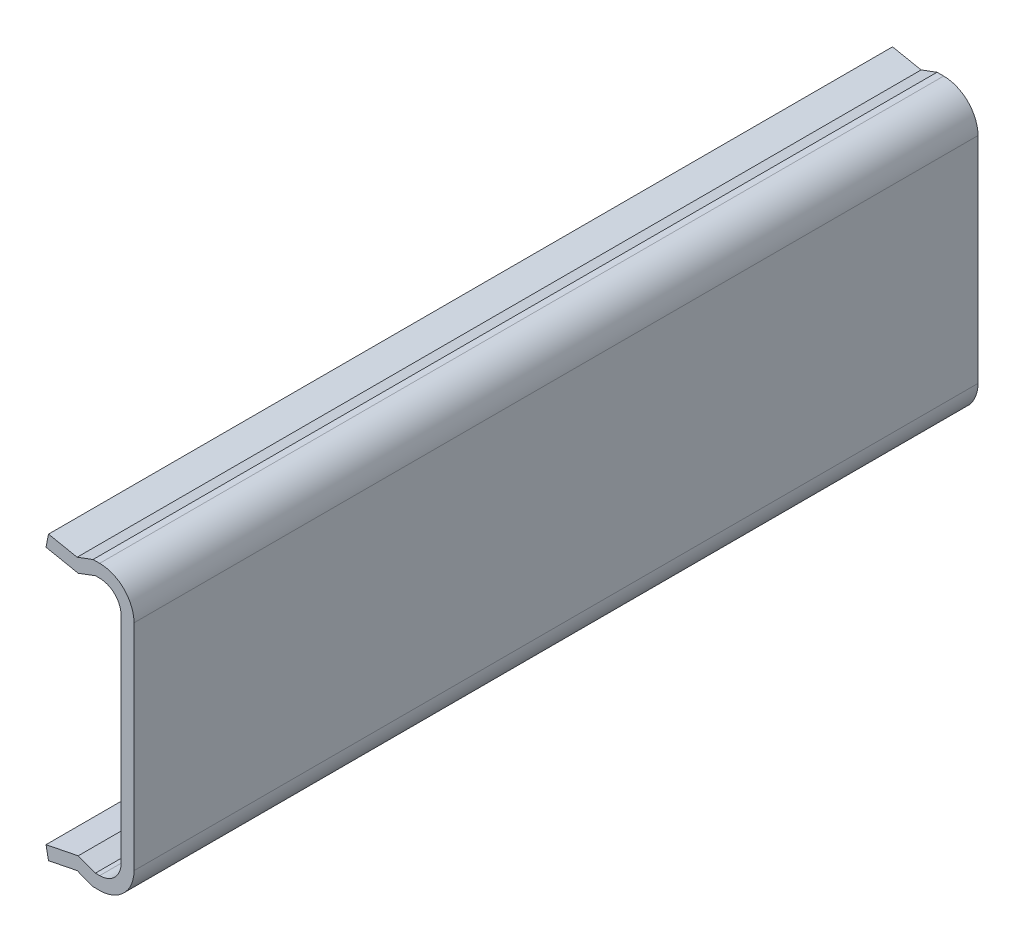
ISO-10303-21;
HEADER;
FILE_DESCRIPTION(('STEP AP214'),'2;1');
FILE_NAME('part.step','',(''),(''),'','','');
FILE_SCHEMA(('AUTOMOTIVE_DESIGN { 1 0 10303 214 1 1 1 1 }'));
ENDSEC;
DATA;
#1=APPLICATION_CONTEXT('core data for automotive mechanical design processes');
#2=APPLICATION_PROTOCOL_DEFINITION('international standard','automotive_design',2000,#1);
#3=PRODUCT_CONTEXT('',#1,'mechanical');
#4=PRODUCT('Part','Part','',(#3));
#5=PRODUCT_RELATED_PRODUCT_CATEGORY('part','',(#4));
#6=PRODUCT_DEFINITION_FORMATION('','',#4);
#7=PRODUCT_DEFINITION_CONTEXT('part definition',#1,'design');
#8=PRODUCT_DEFINITION('design','',#6,#7);
#9=PRODUCT_DEFINITION_SHAPE('','',#8);
#10=(LENGTH_UNIT() NAMED_UNIT(*) SI_UNIT(.MILLI.,.METRE.));
#11=(NAMED_UNIT(*) PLANE_ANGLE_UNIT() SI_UNIT($,.RADIAN.));
#12=(NAMED_UNIT(*) SI_UNIT($,.STERADIAN.) SOLID_ANGLE_UNIT());
#13=UNCERTAINTY_MEASURE_WITH_UNIT(LENGTH_MEASURE(1.E-05),#10,'distance_accuracy_value','');
#14=(GEOMETRIC_REPRESENTATION_CONTEXT(3) GLOBAL_UNCERTAINTY_ASSIGNED_CONTEXT((#13)) GLOBAL_UNIT_ASSIGNED_CONTEXT((#10,
#11,#12)) REPRESENTATION_CONTEXT('',''));
#15=CARTESIAN_POINT('',(0.,0.,0.));
#16=DIRECTION('',(0.,0.,1.));
#17=DIRECTION('',(1.,0.,0.));
#18=AXIS2_PLACEMENT_3D('',#15,#16,#17);
#19=CARTESIAN_POINT('',(46.5672961328672,-11.017405418431,51.1382842231858));
#20=DIRECTION('',(0.196116135138185,-0.98058067569092,0.));
#21=DIRECTION('',(0.98058067569092,0.196116135138185,0.));
#22=AXIS2_PLACEMENT_3D('',#19,#20,#21);
#23=PLANE('',#22);
#24=DIRECTION('',(0.,0.,1.));
#25=VECTOR('',#24,1.);
#26=CARTESIAN_POINT('',(46.5672961328672,-11.017405418431,51.1382842231858));
#27=LINE('',#26,#25);
#28=CARTESIAN_POINT('',(46.5672961328672,-11.017405418431,37.3162004439577));
#29=VERTEX_POINT('',#28);
#30=CARTESIAN_POINT('',(46.5672961328672,-11.017405418431,-2.00379955604232));
#31=VERTEX_POINT('',#30);
#32=EDGE_CURVE('E179',#29,#31,#27,.F.);
#33=ORIENTED_EDGE('',*,*,#32,.T.);
#34=DIRECTION('',(0.98058067569092,0.196116135138185,0.));
#35=VECTOR('',#34,1.);
#36=CARTESIAN_POINT('',(46.5672961328672,-11.017405418431,-2.00379955604231));
#37=LINE('',#36,#35);
#38=CARTESIAN_POINT('',(45.0672961328672,-11.317405418431,-2.00379955604232));
#39=VERTEX_POINT('',#38);
#40=EDGE_CURVE('E233',#39,#31,#37,.T.);
#41=ORIENTED_EDGE('',*,*,#40,.F.);
#42=DIRECTION('',(0.,0.,1.));
#43=VECTOR('',#42,1.);
#44=CARTESIAN_POINT('',(45.0672961328672,-11.317405418431,51.1382842231858));
#45=LINE('',#44,#43);
#46=CARTESIAN_POINT('',(45.0672961328672,-11.317405418431,37.3162004439577));
#47=VERTEX_POINT('',#46);
#48=EDGE_CURVE('E189',#39,#47,#45,.T.);
#49=ORIENTED_EDGE('',*,*,#48,.T.);
#50=DIRECTION('',(0.98058067569092,0.196116135138185,0.));
#51=VECTOR('',#50,1.);
#52=CARTESIAN_POINT('',(46.5672961328672,-11.017405418431,37.3162004439577));
#53=LINE('',#52,#51);
#54=EDGE_CURVE('E224',#29,#47,#53,.F.);
#55=ORIENTED_EDGE('',*,*,#54,.F.);
#56=EDGE_LOOP('',(#33,#41,#49,#55));
#57=FACE_BOUND('',#56,.T.);
#58=ADVANCED_FACE('F16',(#57),#23,.F.);
#59=CARTESIAN_POINT('',(45.0672961328672,0.682594581569037,51.1382842231858));
#60=DIRECTION('',(0.196116135138185,0.98058067569092,0.));
#61=DIRECTION('',(-0.98058067569092,0.196116135138185,0.));
#62=AXIS2_PLACEMENT_3D('',#59,#60,#61);
#63=PLANE('',#62);
#64=DIRECTION('',(0.,0.,1.));
#65=VECTOR('',#64,1.);
#66=CARTESIAN_POINT('',(45.0672961328672,0.682594581569036,51.1382842231858));
#67=LINE('',#66,#65);
#68=CARTESIAN_POINT('',(45.0672961328672,0.682594581569036,37.3162004439577));
#69=VERTEX_POINT('',#68);
#70=CARTESIAN_POINT('',(45.0672961328672,0.682594581569034,-2.00379955604232));
#71=VERTEX_POINT('',#70);
#72=EDGE_CURVE('E209',#69,#71,#67,.F.);
#73=ORIENTED_EDGE('',*,*,#72,.T.);
#74=DIRECTION('',(-0.98058067569092,0.196116135138185,0.));
#75=VECTOR('',#74,1.);
#76=CARTESIAN_POINT('',(45.0672961328672,0.68259458156903,-2.00379955604231));
#77=LINE('',#76,#75);
#78=CARTESIAN_POINT('',(46.5672961328672,0.382594581569031,-2.00379955604229));
#79=VERTEX_POINT('',#78);
#80=EDGE_CURVE('E219',#79,#71,#77,.T.);
#81=ORIENTED_EDGE('',*,*,#80,.F.);
#82=DIRECTION('',(0.,0.,1.));
#83=VECTOR('',#82,1.);
#84=CARTESIAN_POINT('',(46.5672961328672,0.382594581569036,51.1382842231858));
#85=LINE('',#84,#83);
#86=CARTESIAN_POINT('',(46.5672961328672,0.382594581569035,37.3162004439577));
#87=VERTEX_POINT('',#86);
#88=EDGE_CURVE('E162',#79,#87,#85,.T.);
#89=ORIENTED_EDGE('',*,*,#88,.T.);
#90=DIRECTION('',(-0.98058067569092,0.196116135138185,0.));
#91=VECTOR('',#90,1.);
#92=CARTESIAN_POINT('',(45.0672961328672,0.682594581569035,37.3162004439577));
#93=LINE('',#92,#91);
#94=EDGE_CURVE('E216',#69,#87,#93,.F.);
#95=ORIENTED_EDGE('',*,*,#94,.F.);
#96=EDGE_LOOP('',(#73,#81,#89,#95));
#97=FACE_BOUND('',#96,.T.);
#98=ADVANCED_FACE('F348',(#97),#63,.F.);
#99=CARTESIAN_POINT('',(45.0672961328672,0.682594581569037,51.1382842231858));
#100=DIRECTION('',(0.98058067569092,-0.196116135138185,0.));
#101=DIRECTION('',(0.196116135138185,0.98058067569092,0.));
#102=AXIS2_PLACEMENT_3D('',#99,#100,#101);
#103=PLANE('',#102);
#104=DIRECTION('',(0.,0.,1.));
#105=VECTOR('',#104,1.);
#106=CARTESIAN_POINT('',(45.1849658139501,1.27094298698359,51.1382842231858));
#107=LINE('',#106,#105);
#108=CARTESIAN_POINT('',(45.1849658139501,1.27094298698359,37.3162004439577));
#109=VERTEX_POINT('',#108);
#110=CARTESIAN_POINT('',(45.1849658139501,1.27094298698358,-2.00379955604229));
#111=VERTEX_POINT('',#110);
#112=EDGE_CURVE('E151',#109,#111,#107,.F.);
#113=ORIENTED_EDGE('',*,*,#112,.T.);
#114=DIRECTION('',(0.196116135138185,0.98058067569092,0.));
#115=VECTOR('',#114,1.);
#116=CARTESIAN_POINT('',(45.0672961328672,0.682594581569038,-2.00379955604231));
#117=LINE('',#116,#115);
#118=EDGE_CURVE('E204',#71,#111,#117,.T.);
#119=ORIENTED_EDGE('',*,*,#118,.F.);
#120=ORIENTED_EDGE('',*,*,#72,.F.);
#121=DIRECTION('',(0.196116135138185,0.98058067569092,0.));
#122=VECTOR('',#121,1.);
#123=CARTESIAN_POINT('',(45.0672961328672,0.682594581569037,37.3162004439577));
#124=LINE('',#123,#122);
#125=EDGE_CURVE('E195',#109,#69,#124,.F.);
#126=ORIENTED_EDGE('',*,*,#125,.F.);
#127=EDGE_LOOP('',(#113,#119,#120,#126));
#128=FACE_BOUND('',#127,.T.);
#129=ADVANCED_FACE('F442',(#128),#103,.F.);
#130=CARTESIAN_POINT('',(45.0672961328672,-11.317405418431,51.1382842231858));
#131=DIRECTION('',(0.98058067569092,0.196116135138186,0.));
#132=DIRECTION('',(-0.196116135138186,0.98058067569092,0.));
#133=AXIS2_PLACEMENT_3D('',#130,#131,#132);
#134=PLANE('',#133);
#135=ORIENTED_EDGE('',*,*,#48,.F.);
#136=DIRECTION('',(-0.196116135138186,0.98058067569092,0.));
#137=VECTOR('',#136,1.);
#138=CARTESIAN_POINT('',(45.0672961328672,-11.317405418431,-2.00379955604231));
#139=LINE('',#138,#137);
#140=CARTESIAN_POINT('',(45.1849658139501,-11.9057538238455,-2.00379955604229));
#141=VERTEX_POINT('',#140);
#142=EDGE_CURVE('E192',#141,#39,#139,.T.);
#143=ORIENTED_EDGE('',*,*,#142,.F.);
#144=DIRECTION('',(0.,0.,1.));
#145=VECTOR('',#144,1.);
#146=CARTESIAN_POINT('',(45.1849658139501,-11.9057538238455,51.1382842231858));
#147=LINE('',#146,#145);
#148=CARTESIAN_POINT('',(45.1849658139501,-11.9057538238455,37.3162004439577));
#149=VERTEX_POINT('',#148);
#150=EDGE_CURVE('E129',#141,#149,#147,.T.);
#151=ORIENTED_EDGE('',*,*,#150,.T.);
#152=DIRECTION('',(-0.196116135138186,0.98058067569092,0.));
#153=VECTOR('',#152,1.);
#154=CARTESIAN_POINT('',(45.0672961328672,-11.317405418431,37.3162004439577));
#155=LINE('',#154,#153);
#156=EDGE_CURVE('E186',#47,#149,#155,.F.);
#157=ORIENTED_EDGE('',*,*,#156,.F.);
#158=EDGE_LOOP('',(#135,#143,#151,#157));
#159=FACE_BOUND('',#158,.T.);
#160=ADVANCED_FACE('F444',(#159),#134,.F.);
#161=CARTESIAN_POINT('',(47.3672961328672,-11.317405418431,51.1382842231858));
#162=DIRECTION('',(-0.351123441588394,-0.936329177569044,0.));
#163=DIRECTION('',(0.936329177569044,-0.351123441588394,0.));
#164=AXIS2_PLACEMENT_3D('',#161,#162,#163);
#165=PLANE('',#164);
#166=DIRECTION('',(0.,0.,1.));
#167=VECTOR('',#166,1.);
#168=CARTESIAN_POINT('',(47.3672961328672,-11.317405418431,51.1382842231858));
#169=LINE('',#168,#167);
#170=CARTESIAN_POINT('',(47.3672961328672,-11.317405418431,37.3162004439577));
#171=VERTEX_POINT('',#170);
#172=CARTESIAN_POINT('',(47.3672961328672,-11.317405418431,-2.00379955604229));
#173=VERTEX_POINT('',#172);
#174=EDGE_CURVE('E93',#171,#173,#169,.F.);
#175=ORIENTED_EDGE('',*,*,#174,.T.);
#176=DIRECTION('',(0.936329177569044,-0.351123441588394,0.));
#177=VECTOR('',#176,1.);
#178=CARTESIAN_POINT('',(47.3672961328672,-11.317405418431,-2.00379955604231));
#179=LINE('',#178,#177);
#180=EDGE_CURVE('E87',#31,#173,#179,.T.);
#181=ORIENTED_EDGE('',*,*,#180,.F.);
#182=ORIENTED_EDGE('',*,*,#32,.F.);
#183=DIRECTION('',(0.936329177569044,-0.351123441588394,0.));
#184=VECTOR('',#183,1.);
#185=CARTESIAN_POINT('',(47.3672961328672,-11.317405418431,37.3162004439577));
#186=LINE('',#185,#184);
#187=EDGE_CURVE('E168',#171,#29,#186,.F.);
#188=ORIENTED_EDGE('',*,*,#187,.F.);
#189=EDGE_LOOP('',(#175,#181,#182,#188));
#190=FACE_BOUND('',#189,.T.);
#191=ADVANCED_FACE('F451',(#190),#165,.F.);
#192=CARTESIAN_POINT('',(46.5672961328672,0.382594581569037,51.1382842231858));
#193=DIRECTION('',(-0.351123441588394,0.936329177569044,0.));
#194=DIRECTION('',(-0.936329177569044,-0.351123441588394,0.));
#195=AXIS2_PLACEMENT_3D('',#192,#193,#194);
#196=PLANE('',#195);
#197=ORIENTED_EDGE('',*,*,#88,.F.);
#198=DIRECTION('',(-0.936329177569044,-0.351123441588394,0.));
#199=VECTOR('',#198,1.);
#200=CARTESIAN_POINT('',(46.5672961328672,0.382594581569032,-2.00379955604228));
#201=LINE('',#200,#199);
#202=CARTESIAN_POINT('',(47.3672961328672,0.682594581569036,-2.00379955604228));
#203=VERTEX_POINT('',#202);
#204=EDGE_CURVE('E165',#203,#79,#201,.T.);
#205=ORIENTED_EDGE('',*,*,#204,.F.);
#206=DIRECTION('',(0.,0.,1.));
#207=VECTOR('',#206,1.);
#208=CARTESIAN_POINT('',(47.3672961328672,0.682594581569039,51.1382842231858));
#209=LINE('',#208,#207);
#210=CARTESIAN_POINT('',(47.3672961328672,0.682594581569039,37.3162004439577));
#211=VERTEX_POINT('',#210);
#212=EDGE_CURVE('E154',#203,#211,#209,.T.);
#213=ORIENTED_EDGE('',*,*,#212,.T.);
#214=DIRECTION('',(-0.936329177569044,-0.351123441588394,0.));
#215=VECTOR('',#214,1.);
#216=CARTESIAN_POINT('',(46.5672961328672,0.382594581569035,37.3162004439577));
#217=LINE('',#216,#215);
#218=EDGE_CURVE('E159',#87,#211,#217,.F.);
#219=ORIENTED_EDGE('',*,*,#218,.F.);
#220=EDGE_LOOP('',(#197,#205,#213,#219));
#221=FACE_BOUND('',#220,.T.);
#222=ADVANCED_FACE('F341',(#221),#196,.F.);
#223=CARTESIAN_POINT('',(45.1849658139501,1.27094298698359,51.1382842231858));
#224=DIRECTION('',(-0.196116135138185,-0.98058067569092,0.));
#225=DIRECTION('',(0.98058067569092,-0.196116135138185,0.));
#226=AXIS2_PLACEMENT_3D('',#223,#224,#225);
#227=PLANE('',#226);
#228=DIRECTION('',(0.,0.,1.));
#229=VECTOR('',#228,1.);
#230=CARTESIAN_POINT('',(46.5170040645756,1.00453533685849,51.1382842231858));
#231=LINE('',#230,#229);
#232=CARTESIAN_POINT('',(46.5170040645756,1.00453533685849,37.3162004439577));
#233=VERTEX_POINT('',#232);
#234=CARTESIAN_POINT('',(46.5170040645756,1.00453533685849,-2.00379955604228));
#235=VERTEX_POINT('',#234);
#236=EDGE_CURVE('E138',#233,#235,#231,.F.);
#237=ORIENTED_EDGE('',*,*,#236,.T.);
#238=DIRECTION('',(0.98058067569092,-0.196116135138185,0.));
#239=VECTOR('',#238,1.);
#240=CARTESIAN_POINT('',(45.1849658139501,1.27094298698358,-2.00379955604228));
#241=LINE('',#240,#239);
#242=EDGE_CURVE('E147',#111,#235,#241,.T.);
#243=ORIENTED_EDGE('',*,*,#242,.F.);
#244=ORIENTED_EDGE('',*,*,#112,.F.);
#245=DIRECTION('',(0.98058067569092,-0.196116135138185,0.));
#246=VECTOR('',#245,1.);
#247=CARTESIAN_POINT('',(45.1849658139501,1.27094298698359,37.3162004439577));
#248=LINE('',#247,#246);
#249=EDGE_CURVE('E135',#233,#109,#248,.F.);
#250=ORIENTED_EDGE('',*,*,#249,.F.);
#251=EDGE_LOOP('',(#237,#243,#244,#250));
#252=FACE_BOUND('',#251,.T.);
#253=ADVANCED_FACE('F441',(#252),#227,.F.);
#254=CARTESIAN_POINT('',(46.5170040645756,-11.6393461737204,51.1382842231858));
#255=DIRECTION('',(-0.196116135138185,0.98058067569092,0.));
#256=DIRECTION('',(-0.98058067569092,-0.196116135138185,0.));
#257=AXIS2_PLACEMENT_3D('',#254,#255,#256);
#258=PLANE('',#257);
#259=ORIENTED_EDGE('',*,*,#150,.F.);
#260=DIRECTION('',(-0.98058067569092,-0.196116135138185,0.));
#261=VECTOR('',#260,1.);
#262=CARTESIAN_POINT('',(46.5170040645756,-11.6393461737204,-2.00379955604228));
#263=LINE('',#262,#261);
#264=CARTESIAN_POINT('',(46.5170040645756,-11.6393461737204,-2.00379955604231));
#265=VERTEX_POINT('',#264);
#266=EDGE_CURVE('E132',#265,#141,#263,.T.);
#267=ORIENTED_EDGE('',*,*,#266,.F.);
#268=DIRECTION('',(0.,0.,1.));
#269=VECTOR('',#268,1.);
#270=CARTESIAN_POINT('',(46.5170040645756,-11.6393461737204,51.1382842231858));
#271=LINE('',#270,#269);
#272=CARTESIAN_POINT('',(46.5170040645756,-11.6393461737204,37.3162004439577));
#273=VERTEX_POINT('',#272);
#274=EDGE_CURVE('E109',#265,#273,#271,.T.);
#275=ORIENTED_EDGE('',*,*,#274,.T.);
#276=DIRECTION('',(-0.98058067569092,-0.196116135138185,0.));
#277=VECTOR('',#276,1.);
#278=CARTESIAN_POINT('',(46.5170040645756,-11.6393461737204,37.3162004439577));
#279=LINE('',#278,#277);
#280=EDGE_CURVE('E126',#149,#273,#279,.F.);
#281=ORIENTED_EDGE('',*,*,#280,.F.);
#282=EDGE_LOOP('',(#259,#267,#275,#281));
#283=FACE_BOUND('',#282,.T.);
#284=ADVANCED_FACE('F486',(#283),#258,.F.);
#285=CARTESIAN_POINT('',(47.5672961328672,-11.317405418431,51.1382842231858));
#286=DIRECTION('',(0.,-1.,0.));
#287=DIRECTION('',(1.,0.,0.));
#288=AXIS2_PLACEMENT_3D('',#285,#286,#287);
#289=PLANE('',#288);
#290=DIRECTION('',(0.,0.,1.));
#291=VECTOR('',#290,1.);
#292=CARTESIAN_POINT('',(47.5672961328672,-11.317405418431,51.1382842231858));
#293=LINE('',#292,#291);
#294=CARTESIAN_POINT('',(47.5672961328672,-11.317405418431,37.3162004439577));
#295=VERTEX_POINT('',#294);
#296=CARTESIAN_POINT('',(47.5672961328672,-11.317405418431,-2.00379955604228));
#297=VERTEX_POINT('',#296);
#298=EDGE_CURVE('E98',#295,#297,#293,.F.);
#299=ORIENTED_EDGE('',*,*,#298,.T.);
#300=DIRECTION('',(1.,0.,0.));
#301=VECTOR('',#300,1.);
#302=CARTESIAN_POINT('',(47.5672961328672,-11.317405418431,-2.00379955604228));
#303=LINE('',#302,#301);
#304=EDGE_CURVE('E78',#173,#297,#303,.T.);
#305=ORIENTED_EDGE('',*,*,#304,.F.);
#306=ORIENTED_EDGE('',*,*,#174,.F.);
#307=DIRECTION('',(1.,0.,0.));
#308=VECTOR('',#307,1.);
#309=CARTESIAN_POINT('',(47.5672961328672,-11.317405418431,37.3162004439577));
#310=LINE('',#309,#308);
#311=EDGE_CURVE('E92',#295,#171,#310,.F.);
#312=ORIENTED_EDGE('',*,*,#311,.F.);
#313=EDGE_LOOP('',(#299,#305,#306,#312));
#314=FACE_BOUND('',#313,.T.);
#315=ADVANCED_FACE('F104',(#314),#289,.F.);
#316=CARTESIAN_POINT('',(47.3672961328672,0.682594581569039,51.1382842231858));
#317=DIRECTION('',(0.,1.,0.));
#318=DIRECTION('',(0.,0.,1.));
#319=AXIS2_PLACEMENT_3D('',#316,#317,#318);
#320=PLANE('',#319);
#321=ORIENTED_EDGE('',*,*,#212,.F.);
#322=DIRECTION('',(1.,0.,0.));
#323=VECTOR('',#322,1.);
#324=CARTESIAN_POINT('',(47.3672961328672,0.682594581569036,-2.00379955604228));
#325=LINE('',#324,#323);
#326=CARTESIAN_POINT('',(47.5672961328672,0.682594581569035,-2.00379955604228));
#327=VERTEX_POINT('',#326);
#328=EDGE_CURVE('E116',#327,#203,#325,.F.);
#329=ORIENTED_EDGE('',*,*,#328,.F.);
#330=DIRECTION('',(0.,0.,1.));
#331=VECTOR('',#330,1.);
#332=CARTESIAN_POINT('',(47.5672961328672,0.682594581569037,51.1382842231858));
#333=LINE('',#332,#331);
#334=CARTESIAN_POINT('',(47.5672961328672,0.682594581569037,37.3162004439577));
#335=VERTEX_POINT('',#334);
#336=EDGE_CURVE('E263',#327,#335,#333,.T.);
#337=ORIENTED_EDGE('',*,*,#336,.T.);
#338=DIRECTION('',(1.,0.,0.));
#339=VECTOR('',#338,1.);
#340=CARTESIAN_POINT('',(47.3672961328672,0.682594581569038,37.3162004439577));
#341=LINE('',#340,#339);
#342=EDGE_CURVE('E142',#211,#335,#341,.T.);
#343=ORIENTED_EDGE('',*,*,#342,.F.);
#344=EDGE_LOOP('',(#321,#329,#337,#343));
#345=FACE_BOUND('',#344,.T.);
#346=ADVANCED_FACE('F331',(#345),#320,.F.);
#347=CARTESIAN_POINT('',(46.5170040645756,1.00453533685849,51.1382842231858));
#348=DIRECTION('',(0.351123441588394,-0.936329177569044,0.));
#349=DIRECTION('',(0.936329177569044,0.351123441588394,0.));
#350=AXIS2_PLACEMENT_3D('',#347,#348,#349);
#351=PLANE('',#350);
#352=DIRECTION('',(0.,0.,-1.));
#353=VECTOR('',#352,1.);
#354=CARTESIAN_POINT('',(47.2584953838037,1.28259458156904,51.1382842231858));
#355=LINE('',#354,#353);
#356=CARTESIAN_POINT('',(47.2584953838037,1.28259458156904,37.3162004439577));
#357=VERTEX_POINT('',#356);
#358=CARTESIAN_POINT('',(47.2584953838037,1.28259458156903,-2.00379955604228));
#359=VERTEX_POINT('',#358);
#360=EDGE_CURVE('E262',#357,#359,#355,.T.);
#361=ORIENTED_EDGE('',*,*,#360,.T.);
#362=DIRECTION('',(0.936329177569044,0.351123441588394,0.));
#363=VECTOR('',#362,1.);
#364=CARTESIAN_POINT('',(46.5170040645756,1.00453533685849,-2.00379955604228));
#365=LINE('',#364,#363);
#366=EDGE_CURVE('E141',#235,#359,#365,.T.);
#367=ORIENTED_EDGE('',*,*,#366,.F.);
#368=ORIENTED_EDGE('',*,*,#236,.F.);
#369=DIRECTION('',(0.936329177569044,0.351123441588394,0.));
#370=VECTOR('',#369,1.);
#371=CARTESIAN_POINT('',(46.5170040645756,1.00453533685849,37.3162004439577));
#372=LINE('',#371,#370);
#373=EDGE_CURVE('E301',#357,#233,#372,.F.);
#374=ORIENTED_EDGE('',*,*,#373,.F.);
#375=EDGE_LOOP('',(#361,#367,#368,#374));
#376=FACE_BOUND('',#375,.T.);
#377=ADVANCED_FACE('F415',(#376),#351,.F.);
#378=CARTESIAN_POINT('',(47.2584953838037,-11.917405418431,51.1382842231858));
#379=DIRECTION('',(0.351123441588394,0.936329177569044,0.));
#380=DIRECTION('',(-0.936329177569044,0.351123441588394,0.));
#381=AXIS2_PLACEMENT_3D('',#378,#379,#380);
#382=PLANE('',#381);
#383=ORIENTED_EDGE('',*,*,#274,.F.);
#384=DIRECTION('',(-0.936329177569044,0.351123441588394,0.));
#385=VECTOR('',#384,1.);
#386=CARTESIAN_POINT('',(47.2584953838037,-11.917405418431,-2.00379955604231));
#387=LINE('',#386,#385);
#388=CARTESIAN_POINT('',(47.2584953838037,-11.917405418431,-2.00379955604229));
#389=VERTEX_POINT('',#388);
#390=EDGE_CURVE('E123',#389,#265,#387,.T.);
#391=ORIENTED_EDGE('',*,*,#390,.F.);
#392=DIRECTION('',(0.,0.,1.));
#393=VECTOR('',#392,1.);
#394=CARTESIAN_POINT('',(47.2584953838037,-11.917405418431,51.1382842231858));
#395=LINE('',#394,#393);
#396=CARTESIAN_POINT('',(47.2584953838037,-11.917405418431,37.3162004439577));
#397=VERTEX_POINT('',#396);
#398=EDGE_CURVE('E281',#389,#397,#395,.T.);
#399=ORIENTED_EDGE('',*,*,#398,.T.);
#400=DIRECTION('',(-0.936329177569044,0.351123441588394,0.));
#401=VECTOR('',#400,1.);
#402=CARTESIAN_POINT('',(47.2584953838037,-11.917405418431,37.3162004439577));
#403=LINE('',#402,#401);
#404=EDGE_CURVE('E106',#273,#397,#403,.F.);
#405=ORIENTED_EDGE('',*,*,#404,.F.);
#406=EDGE_LOOP('',(#383,#391,#399,#405));
#407=FACE_BOUND('',#406,.T.);
#408=ADVANCED_FACE('F476',(#407),#382,.F.);
#409=CARTESIAN_POINT('',(47.5672961328672,-10.317405418431,51.1382842231858));
#410=DIRECTION('',(0.,0.,1.));
#411=DIRECTION('',(0.,-1.,0.));
#412=AXIS2_PLACEMENT_3D('',#409,#410,#411);
#413=CYLINDRICAL_SURFACE('',#412,0.999999999999999);
#414=DIRECTION('',(0.,0.,1.));
#415=VECTOR('',#414,1.);
#416=CARTESIAN_POINT('',(48.5672961328672,-10.317405418431,51.1382842231858));
#417=LINE('',#416,#415);
#418=CARTESIAN_POINT('',(48.5672961328672,-10.317405418431,37.3162004439577));
#419=VERTEX_POINT('',#418);
#420=CARTESIAN_POINT('',(48.5672961328672,-10.317405418431,-2.00379955604228));
#421=VERTEX_POINT('',#420);
#422=EDGE_CURVE('E101',#419,#421,#417,.F.);
#423=ORIENTED_EDGE('',*,*,#422,.T.);
#424=CARTESIAN_POINT('',(47.5672961328672,-10.317405418431,-2.00379955604228));
#425=DIRECTION('',(0.,0.,1.));
#426=DIRECTION('',(0.,-1.,0.));
#427=AXIS2_PLACEMENT_3D('',#424,#425,#426);
#428=CIRCLE('',#427,0.999999999999999);
#429=EDGE_CURVE('E19',#297,#421,#428,.T.);
#430=ORIENTED_EDGE('',*,*,#429,.F.);
#431=ORIENTED_EDGE('',*,*,#298,.F.);
#432=CARTESIAN_POINT('',(47.5672961328672,-10.317405418431,37.3162004439577));
#433=DIRECTION('',(0.,0.,1.));
#434=DIRECTION('',(0.,-1.,0.));
#435=AXIS2_PLACEMENT_3D('',#432,#433,#434);
#436=CIRCLE('',#435,0.999999999999999);
#437=EDGE_CURVE('E103',#419,#295,#436,.F.);
#438=ORIENTED_EDGE('',*,*,#437,.F.);
#439=EDGE_LOOP('',(#423,#430,#431,#438));
#440=FACE_BOUND('',#439,.T.);
#441=ADVANCED_FACE('F97',(#440),#413,.F.);
#442=CARTESIAN_POINT('',(47.5672961328672,-0.317405418430965,51.1382842231858));
#443=DIRECTION('',(0.,0.,1.));
#444=DIRECTION('',(0.,-1.,0.));
#445=AXIS2_PLACEMENT_3D('',#442,#443,#444);
#446=CYLINDRICAL_SURFACE('',#445,1.);
#447=ORIENTED_EDGE('',*,*,#336,.F.);
#448=CARTESIAN_POINT('',(47.5672961328672,-0.317405418430969,-2.00379955604228));
#449=DIRECTION('',(0.,0.,1.));
#450=DIRECTION('',(0.,-1.,0.));
#451=AXIS2_PLACEMENT_3D('',#448,#449,#450);
#452=CIRCLE('',#451,1.);
#453=CARTESIAN_POINT('',(48.5672961328672,-0.317405418430971,-2.00379955604228));
#454=VERTEX_POINT('',#453);
#455=EDGE_CURVE('E264',#454,#327,#452,.T.);
#456=ORIENTED_EDGE('',*,*,#455,.F.);
#457=DIRECTION('',(0.,0.,1.));
#458=VECTOR('',#457,1.);
#459=CARTESIAN_POINT('',(48.5672961328672,-0.317405418430972,51.1382842231858));
#460=LINE('',#459,#458);
#461=CARTESIAN_POINT('',(48.5672961328672,-0.317405418430969,37.3162004439577));
#462=VERTEX_POINT('',#461);
#463=EDGE_CURVE('E275',#454,#462,#460,.T.);
#464=ORIENTED_EDGE('',*,*,#463,.T.);
#465=CARTESIAN_POINT('',(47.5672961328672,-0.317405418430966,37.3162004439577));
#466=DIRECTION('',(0.,0.,1.));
#467=DIRECTION('',(0.,-1.,0.));
#468=AXIS2_PLACEMENT_3D('',#465,#466,#467);
#469=CIRCLE('',#468,1.);
#470=EDGE_CURVE('E260',#335,#462,#469,.F.);
#471=ORIENTED_EDGE('',*,*,#470,.F.);
#472=EDGE_LOOP('',(#447,#456,#464,#471));
#473=FACE_BOUND('',#472,.T.);
#474=ADVANCED_FACE('F335',(#473),#446,.F.);
#475=CARTESIAN_POINT('',(47.2584953838037,1.28259458156904,51.1382842231858));
#476=DIRECTION('',(0.,-1.,0.));
#477=DIRECTION('',(0.,0.,-1.));
#478=AXIS2_PLACEMENT_3D('',#475,#476,#477);
#479=PLANE('',#478);
#480=DIRECTION('',(0.,0.,1.));
#481=VECTOR('',#480,1.);
#482=CARTESIAN_POINT('',(47.5672961328672,1.28259458156904,51.1382842231858));
#483=LINE('',#482,#481);
#484=CARTESIAN_POINT('',(47.5672961328672,1.28259458156903,-2.00379955604228));
#485=VERTEX_POINT('',#484);
#486=CARTESIAN_POINT('',(47.5672961328672,1.28259458156904,37.3162004439577));
#487=VERTEX_POINT('',#486);
#488=EDGE_CURVE('E279',#485,#487,#483,.T.);
#489=ORIENTED_EDGE('',*,*,#488,.F.);
#490=DIRECTION('',(1.,0.,0.));
#491=VECTOR('',#490,1.);
#492=CARTESIAN_POINT('',(47.2584953838037,1.28259458156903,-2.00379955604228));
#493=LINE('',#492,#491);
#494=EDGE_CURVE('E292',#359,#485,#493,.T.);
#495=ORIENTED_EDGE('',*,*,#494,.F.);
#496=ORIENTED_EDGE('',*,*,#360,.F.);
#497=DIRECTION('',(1.,0.,0.));
#498=VECTOR('',#497,1.);
#499=CARTESIAN_POINT('',(47.2584953838037,1.28259458156904,37.3162004439577));
#500=LINE('',#499,#498);
#501=EDGE_CURVE('E289',#487,#357,#500,.F.);
#502=ORIENTED_EDGE('',*,*,#501,.F.);
#503=EDGE_LOOP('',(#489,#495,#496,#502));
#504=FACE_BOUND('',#503,.T.);
#505=ADVANCED_FACE('F411',(#504),#479,.F.);
#506=CARTESIAN_POINT('',(47.5672961328672,-11.917405418431,51.1382842231858));
#507=DIRECTION('',(0.,1.,0.));
#508=DIRECTION('',(0.,0.,1.));
#509=AXIS2_PLACEMENT_3D('',#506,#507,#508);
#510=PLANE('',#509);
#511=ORIENTED_EDGE('',*,*,#398,.F.);
#512=DIRECTION('',(1.,0.,0.));
#513=VECTOR('',#512,1.);
#514=CARTESIAN_POINT('',(47.5672961328672,-11.917405418431,-2.00379955604228));
#515=LINE('',#514,#513);
#516=CARTESIAN_POINT('',(47.5672961328672,-11.917405418431,-2.00379955604228));
#517=VERTEX_POINT('',#516);
#518=EDGE_CURVE('E259',#389,#517,#515,.T.);
#519=ORIENTED_EDGE('',*,*,#518,.T.);
#520=DIRECTION('',(0.,0.,1.));
#521=VECTOR('',#520,1.);
#522=CARTESIAN_POINT('',(47.5672961328672,-11.917405418431,51.1382842231858));
#523=LINE('',#522,#521);
#524=CARTESIAN_POINT('',(47.5672961328672,-11.917405418431,37.3162004439577));
#525=VERTEX_POINT('',#524);
#526=EDGE_CURVE('E255',#525,#517,#523,.F.);
#527=ORIENTED_EDGE('',*,*,#526,.F.);
#528=DIRECTION('',(1.,0.,0.));
#529=VECTOR('',#528,1.);
#530=CARTESIAN_POINT('',(47.5672961328672,-11.917405418431,37.3162004439577));
#531=LINE('',#530,#529);
#532=EDGE_CURVE('E276',#397,#525,#531,.T.);
#533=ORIENTED_EDGE('',*,*,#532,.F.);
#534=EDGE_LOOP('',(#511,#519,#527,#533));
#535=FACE_BOUND('',#534,.T.);
#536=ADVANCED_FACE('F383',(#535),#510,.F.);
#537=CARTESIAN_POINT('',(48.5672961328672,-0.317405418430965,51.1382842231858));
#538=DIRECTION('',(1.,0.,0.));
#539=DIRECTION('',(0.,1.,0.));
#540=AXIS2_PLACEMENT_3D('',#537,#538,#539);
#541=PLANE('',#540);
#542=ORIENTED_EDGE('',*,*,#463,.F.);
#543=DIRECTION('',(0.,-1.,0.));
#544=VECTOR('',#543,1.);
#545=CARTESIAN_POINT('',(48.5672961328672,-0.317405418430972,-2.00379955604228));
#546=LINE('',#545,#544);
#547=EDGE_CURVE('E274',#454,#421,#546,.T.);
#548=ORIENTED_EDGE('',*,*,#547,.T.);
#549=ORIENTED_EDGE('',*,*,#422,.F.);
#550=DIRECTION('',(0.,-1.,0.));
#551=VECTOR('',#550,1.);
#552=CARTESIAN_POINT('',(48.5672961328672,-10.317405418431,37.3162004439577));
#553=LINE('',#552,#551);
#554=EDGE_CURVE('E252',#462,#419,#553,.T.);
#555=ORIENTED_EDGE('',*,*,#554,.F.);
#556=EDGE_LOOP('',(#542,#548,#549,#555));
#557=FACE_BOUND('',#556,.T.);
#558=ADVANCED_FACE('F273',(#557),#541,.F.);
#559=CARTESIAN_POINT('',(47.5672961328672,-0.317405418430965,51.1382842231858));
#560=DIRECTION('',(0.,0.,1.));
#561=DIRECTION('',(0.,-1.,0.));
#562=AXIS2_PLACEMENT_3D('',#559,#560,#561);
#563=CYLINDRICAL_SURFACE('',#562,1.6);
#564=CARTESIAN_POINT('',(47.5672961328672,-0.317405418430969,-2.00379955604228));
#565=DIRECTION('',(0.,0.,1.));
#566=DIRECTION('',(0.,-1.,0.));
#567=AXIS2_PLACEMENT_3D('',#564,#565,#566);
#568=CIRCLE('',#567,1.6);
#569=CARTESIAN_POINT('',(49.1672961328672,-0.317405418430968,-2.00379955604228));
#570=VERTEX_POINT('',#569);
#571=EDGE_CURVE('E256',#570,#485,#568,.T.);
#572=ORIENTED_EDGE('',*,*,#571,.T.);
#573=ORIENTED_EDGE('',*,*,#488,.T.);
#574=CARTESIAN_POINT('',(47.5672961328672,-0.317405418430966,37.3162004439577));
#575=DIRECTION('',(0.,0.,1.));
#576=DIRECTION('',(0.,-1.,0.));
#577=AXIS2_PLACEMENT_3D('',#574,#575,#576);
#578=CIRCLE('',#577,1.6);
#579=CARTESIAN_POINT('',(49.1672961328672,-0.317405418430967,37.3162004439577));
#580=VERTEX_POINT('',#579);
#581=EDGE_CURVE('E247',#580,#487,#578,.T.);
#582=ORIENTED_EDGE('',*,*,#581,.F.);
#583=DIRECTION('',(0.,0.,1.));
#584=VECTOR('',#583,1.);
#585=CARTESIAN_POINT('',(49.1672961328672,-0.317405418430967,51.1382842231858));
#586=LINE('',#585,#584);
#587=EDGE_CURVE('E250',#580,#570,#586,.F.);
#588=ORIENTED_EDGE('',*,*,#587,.T.);
#589=EDGE_LOOP('',(#572,#573,#582,#588));
#590=FACE_BOUND('',#589,.T.);
#591=ADVANCED_FACE('F406',(#590),#563,.T.);
#592=CARTESIAN_POINT('',(47.5672961328672,-0.317405418430972,-2.00379955604228));
#593=DIRECTION('',(0.,0.,1.));
#594=DIRECTION('',(0.,-1.,0.));
#595=AXIS2_PLACEMENT_3D('',#592,#593,#594);
#596=PLANE('',#595);
#597=ORIENTED_EDGE('',*,*,#242,.T.);
#598=ORIENTED_EDGE('',*,*,#366,.T.);
#599=ORIENTED_EDGE('',*,*,#494,.T.);
#600=ORIENTED_EDGE('',*,*,#571,.F.);
#601=DIRECTION('',(0.,-1.,0.));
#602=VECTOR('',#601,1.);
#603=CARTESIAN_POINT('',(49.1672961328672,-0.317405418430964,-2.00379955604228));
#604=LINE('',#603,#602);
#605=CARTESIAN_POINT('',(49.1672961328672,-10.317405418431,-2.00379955604228));
#606=VERTEX_POINT('',#605);
#607=EDGE_CURVE('E393',#570,#606,#604,.T.);
#608=ORIENTED_EDGE('',*,*,#607,.T.);
#609=CARTESIAN_POINT('',(47.5672961328672,-10.317405418431,-2.00379955604228));
#610=DIRECTION('',(0.,0.,1.));
#611=DIRECTION('',(0.,-1.,0.));
#612=AXIS2_PLACEMENT_3D('',#609,#610,#611);
#613=CIRCLE('',#612,1.6);
#614=EDGE_CURVE('E253',#517,#606,#613,.T.);
#615=ORIENTED_EDGE('',*,*,#614,.F.);
#616=ORIENTED_EDGE('',*,*,#518,.F.);
#617=ORIENTED_EDGE('',*,*,#390,.T.);
#618=ORIENTED_EDGE('',*,*,#266,.T.);
#619=ORIENTED_EDGE('',*,*,#142,.T.);
#620=ORIENTED_EDGE('',*,*,#40,.T.);
#621=ORIENTED_EDGE('',*,*,#180,.T.);
#622=ORIENTED_EDGE('',*,*,#304,.T.);
#623=ORIENTED_EDGE('',*,*,#429,.T.);
#624=ORIENTED_EDGE('',*,*,#547,.F.);
#625=ORIENTED_EDGE('',*,*,#455,.T.);
#626=ORIENTED_EDGE('',*,*,#328,.T.);
#627=ORIENTED_EDGE('',*,*,#204,.T.);
#628=ORIENTED_EDGE('',*,*,#80,.T.);
#629=ORIENTED_EDGE('',*,*,#118,.T.);
#630=EDGE_LOOP('',(#597,#598,#599,#600,#608,#615,#616,#617,#618,#619,#620,#621,#622,#623,#624,
#625,#626,#627,#628,#629));
#631=FACE_BOUND('',#630,.T.);
#632=ADVANCED_FACE('F81',(#631),#596,.F.);
#633=CARTESIAN_POINT('',(47.5672961328672,-10.317405418431,51.1382842231858));
#634=DIRECTION('',(0.,0.,1.));
#635=DIRECTION('',(0.,-1.,0.));
#636=AXIS2_PLACEMENT_3D('',#633,#634,#635);
#637=CYLINDRICAL_SURFACE('',#636,1.6);
#638=ORIENTED_EDGE('',*,*,#614,.T.);
#639=DIRECTION('',(0.,0.,1.));
#640=VECTOR('',#639,1.);
#641=CARTESIAN_POINT('',(49.1672961328672,-10.317405418431,51.1382842231858));
#642=LINE('',#641,#640);
#643=CARTESIAN_POINT('',(49.1672961328672,-10.317405418431,37.3162004439577));
#644=VERTEX_POINT('',#643);
#645=EDGE_CURVE('E25',#606,#644,#642,.T.);
#646=ORIENTED_EDGE('',*,*,#645,.T.);
#647=CARTESIAN_POINT('',(47.5672961328672,-10.317405418431,37.3162004439577));
#648=DIRECTION('',(0.,0.,1.));
#649=DIRECTION('',(0.,-1.,0.));
#650=AXIS2_PLACEMENT_3D('',#647,#648,#649);
#651=CIRCLE('',#650,1.6);
#652=EDGE_CURVE('E33',#525,#644,#651,.T.);
#653=ORIENTED_EDGE('',*,*,#652,.F.);
#654=ORIENTED_EDGE('',*,*,#526,.T.);
#655=EDGE_LOOP('',(#638,#646,#653,#654));
#656=FACE_BOUND('',#655,.T.);
#657=ADVANCED_FACE('F388',(#656),#637,.T.);
#658=CARTESIAN_POINT('',(47.5672961328672,-10.317405418431,37.3162004439577));
#659=DIRECTION('',(0.,0.,1.));
#660=DIRECTION('',(0.,-1.,0.));
#661=AXIS2_PLACEMENT_3D('',#658,#659,#660);
#662=PLANE('',#661);
#663=ORIENTED_EDGE('',*,*,#501,.T.);
#664=ORIENTED_EDGE('',*,*,#373,.T.);
#665=ORIENTED_EDGE('',*,*,#249,.T.);
#666=ORIENTED_EDGE('',*,*,#125,.T.);
#667=ORIENTED_EDGE('',*,*,#94,.T.);
#668=ORIENTED_EDGE('',*,*,#218,.T.);
#669=ORIENTED_EDGE('',*,*,#342,.T.);
#670=ORIENTED_EDGE('',*,*,#470,.T.);
#671=ORIENTED_EDGE('',*,*,#554,.T.);
#672=ORIENTED_EDGE('',*,*,#437,.T.);
#673=ORIENTED_EDGE('',*,*,#311,.T.);
#674=ORIENTED_EDGE('',*,*,#187,.T.);
#675=ORIENTED_EDGE('',*,*,#54,.T.);
#676=ORIENTED_EDGE('',*,*,#156,.T.);
#677=ORIENTED_EDGE('',*,*,#280,.T.);
#678=ORIENTED_EDGE('',*,*,#404,.T.);
#679=ORIENTED_EDGE('',*,*,#532,.T.);
#680=ORIENTED_EDGE('',*,*,#652,.T.);
#681=DIRECTION('',(0.,-1.,0.));
#682=VECTOR('',#681,1.);
#683=CARTESIAN_POINT('',(49.1672961328672,-0.317405418430964,37.3162004439577));
#684=LINE('',#683,#682);
#685=EDGE_CURVE('E11',#644,#580,#684,.F.);
#686=ORIENTED_EDGE('',*,*,#685,.T.);
#687=ORIENTED_EDGE('',*,*,#581,.T.);
#688=EDGE_LOOP('',(#663,#664,#665,#666,#667,#668,#669,#670,#671,#672,#673,#674,#675,#676,#677,
#678,#679,#680,#686,#687));
#689=FACE_BOUND('',#688,.T.);
#690=ADVANCED_FACE('F268',(#689),#662,.T.);
#691=CARTESIAN_POINT('',(49.1672961328672,-0.317405418430964,51.1382842231858));
#692=DIRECTION('',(-1.,0.,0.));
#693=DIRECTION('',(0.,-1.,0.));
#694=AXIS2_PLACEMENT_3D('',#691,#692,#693);
#695=PLANE('',#694);
#696=ORIENTED_EDGE('',*,*,#645,.F.);
#697=ORIENTED_EDGE('',*,*,#607,.F.);
#698=ORIENTED_EDGE('',*,*,#587,.F.);
#699=ORIENTED_EDGE('',*,*,#685,.F.);
#700=EDGE_LOOP('',(#696,#697,#698,#699));
#701=FACE_BOUND('',#700,.T.);
#702=ADVANCED_FACE('F408',(#701),#695,.F.);
#703=CLOSED_SHELL('',(#58,#98,#129,#160,#191,#222,#253,#284,#315,#346,#377,#408,#441,#474,#505,
#536,#558,#591,#632,#657,#690,#702));
#704=MANIFOLD_SOLID_BREP('B1',#703);
#705=ADVANCED_BREP_SHAPE_REPRESENTATION('',(#18,#704),#14);
#706=SHAPE_DEFINITION_REPRESENTATION(#9,#705);
ENDSEC;
END-ISO-10303-21;
